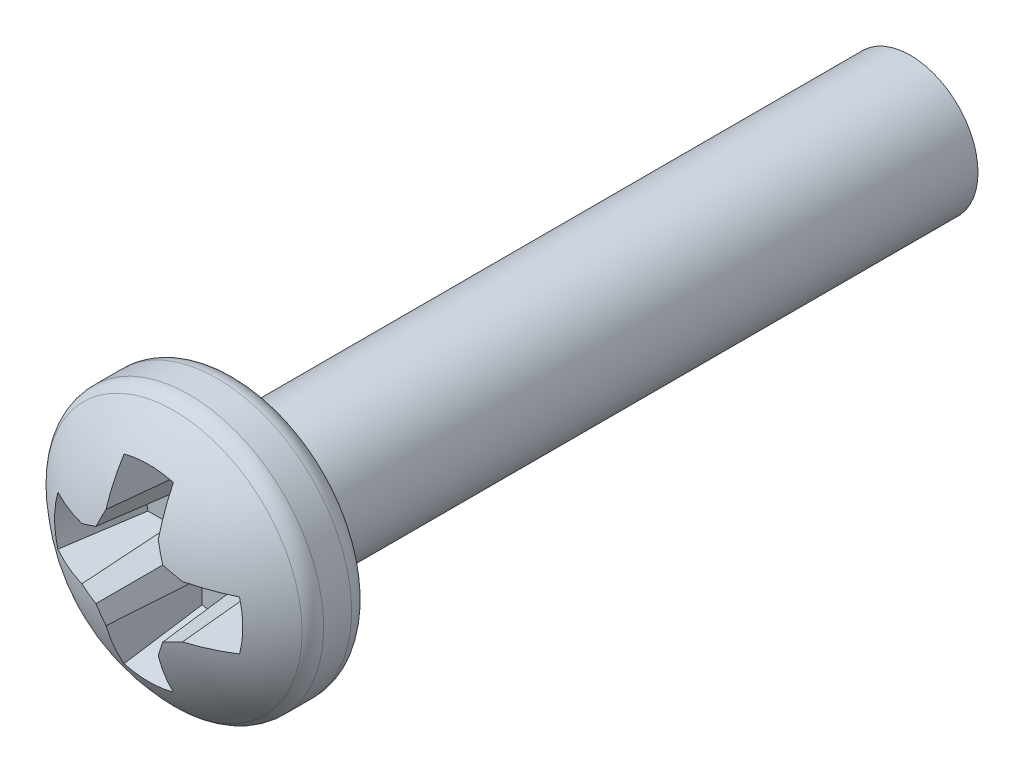
ISO-10303-21;
HEADER;
FILE_DESCRIPTION(('STEP AP214'),'2;1');
FILE_NAME('part.step','',(''),(''),'','','');
FILE_SCHEMA(('AUTOMOTIVE_DESIGN { 1 0 10303 214 1 1 1 1 }'));
ENDSEC;
DATA;
#1=APPLICATION_CONTEXT('core data for automotive mechanical design processes');
#2=APPLICATION_PROTOCOL_DEFINITION('international standard','automotive_design',2000,#1);
#3=PRODUCT_CONTEXT('',#1,'mechanical');
#4=PRODUCT('Part','Part','',(#3));
#5=PRODUCT_RELATED_PRODUCT_CATEGORY('part','',(#4));
#6=PRODUCT_DEFINITION_FORMATION('','',#4);
#7=PRODUCT_DEFINITION_CONTEXT('part definition',#1,'design');
#8=PRODUCT_DEFINITION('design','',#6,#7);
#9=PRODUCT_DEFINITION_SHAPE('','',#8);
#10=(LENGTH_UNIT() NAMED_UNIT(*) SI_UNIT(.MILLI.,.METRE.));
#11=(NAMED_UNIT(*) PLANE_ANGLE_UNIT() SI_UNIT($,.RADIAN.));
#12=(NAMED_UNIT(*) SI_UNIT($,.STERADIAN.) SOLID_ANGLE_UNIT());
#13=UNCERTAINTY_MEASURE_WITH_UNIT(LENGTH_MEASURE(1.E-05),#10,'distance_accuracy_value','');
#14=(GEOMETRIC_REPRESENTATION_CONTEXT(3) GLOBAL_UNCERTAINTY_ASSIGNED_CONTEXT((#13)) GLOBAL_UNIT_ASSIGNED_CONTEXT((#10,
#11,#12)) REPRESENTATION_CONTEXT('',''));
#15=CARTESIAN_POINT('',(0.,0.,0.));
#16=DIRECTION('',(0.,0.,1.));
#17=DIRECTION('',(1.,0.,0.));
#18=AXIS2_PLACEMENT_3D('',#15,#16,#17);
#19=CARTESIAN_POINT('',(0.251256313292348,0.606586399182261,11.7));
#20=DIRECTION('',(-0.381227206369648,-0.920363891963227,0.0871557427476583));
#21=DIRECTION('',(0.923879532511289,-0.382683432365084,0.));
#22=AXIS2_PLACEMENT_3D('',#19,#20,#21);
#23=PLANE('',#22);
#24=DIRECTION('',(0.923879532511289,-0.382683432365084,0.));
#25=VECTOR('',#24,1.);
#26=CARTESIAN_POINT('',(0.202877045628459,0.489788515050419,10.255));
#27=LINE('',#26,#25);
#28=CARTESIAN_POINT('',(0.405754091256926,0.405754091256925,10.255));
#29=VERTEX_POINT('',#28);
#30=CARTESIAN_POINT('',(0.72485327597371,0.273578881205037,10.255));
#31=VERTEX_POINT('',#30);
#32=EDGE_CURVE('E175',#29,#31,#27,.T.);
#33=ORIENTED_EDGE('',*,*,#32,.T.);
#34=DIRECTION('',(-0.0173337504938599,-0.0871426484044397,-0.996045029063886));
#35=VECTOR('',#34,1.);
#36=CARTESIAN_POINT('',(0.747722237309717,0.388548913673446,11.5691134843641));
#37=LINE('',#36,#35);
#38=CARTESIAN_POINT('',(0.747722237309717,0.388548913673446,11.5691134843641));
#39=VERTEX_POINT('',#38);
#40=EDGE_CURVE('E178',#39,#31,#37,.T.);
#41=ORIENTED_EDGE('',*,*,#40,.F.);
#42=CARTESIAN_POINT('',(0.747722237309717,0.388548913673446,11.5691134843641));
#43=CARTESIAN_POINT('',(0.706240595369678,0.406589864651121,11.5781812676126));
#44=CARTESIAN_POINT('',(0.664562351791498,0.42460402789441,11.5861062190338));
#45=CARTESIAN_POINT('',(0.580812661358855,0.460578778912214,11.5996704582213));
#46=CARTESIAN_POINT('',(0.538741214504392,0.47853936668673,11.6053097459877));
#47=CARTESIAN_POINT('',(0.496473166011788,0.496473166726859,11.6098062019267));
#48=B_SPLINE_CURVE_WITH_KNOTS('',3,(#42,#43,#44,#45,#46,#47),.UNSPECIFIED.,.F.,.F.,(4,2,4),(0.,
0.138273346243273,0.276546692486546),.UNSPECIFIED.);
#49=CARTESIAN_POINT('',(0.496473166111229,0.496473166977632,11.609806201862));
#50=VERTEX_POINT('',#49);
#51=EDGE_CURVE('E161',#39,#50,#48,.T.);
#52=ORIENTED_EDGE('',*,*,#51,.T.);
#53=DIRECTION('',(0.0666626913468327,0.0666626913468324,0.995546167269401));
#54=VECTOR('',#53,1.);
#55=CARTESIAN_POINT('',(0.405754091256926,0.405754091256925,10.255));
#56=LINE('',#55,#54);
#57=EDGE_CURVE('E187',#29,#50,#56,.T.);
#58=ORIENTED_EDGE('',*,*,#57,.F.);
#59=EDGE_LOOP('',(#33,#41,#52,#58));
#60=FACE_BOUND('',#59,.T.);
#61=ADVANCED_FACE('F17',(#60),#23,.T.);
#62=CARTESIAN_POINT('',(0.251256313292361,-0.60658639918228,11.7));
#63=DIRECTION('',(-0.381227206369641,0.920363891963229,0.0871557427476603));
#64=DIRECTION('',(-0.923879532511292,-0.382683432365078,0.));
#65=AXIS2_PLACEMENT_3D('',#62,#63,#64);
#66=PLANE('',#65);
#67=DIRECTION('',(-0.923879532511292,-0.382683432365078,0.));
#68=VECTOR('',#67,1.);
#69=CARTESIAN_POINT('',(0.202877045628472,-0.489788515050435,10.255));
#70=LINE('',#69,#68);
#71=CARTESIAN_POINT('',(0.724853275973724,-0.273578881205057,10.255));
#72=VERTEX_POINT('',#71);
#73=CARTESIAN_POINT('',(0.405754091256938,-0.405754091256942,10.255));
#74=VERTEX_POINT('',#73);
#75=EDGE_CURVE('E357',#72,#74,#70,.T.);
#76=ORIENTED_EDGE('',*,*,#75,.T.);
#77=DIRECTION('',(-0.0666626913468337,0.0666626913468343,-0.995546167269401));
#78=VECTOR('',#77,1.);
#79=CARTESIAN_POINT('',(0.49647316651386,-0.496473166513865,11.6098062018733));
#80=LINE('',#79,#78);
#81=CARTESIAN_POINT('',(0.496473166867044,-0.496473166364015,11.6098062018357));
#82=VERTEX_POINT('',#81);
#83=EDGE_CURVE('E347',#82,#74,#80,.T.);
#84=ORIENTED_EDGE('',*,*,#83,.F.);
#85=CARTESIAN_POINT('',(0.496473167220227,-0.496473166214166,11.6098062017981));
#86=CARTESIAN_POINT('',(0.538741215508183,-0.47853936625876,11.6053097458587));
#87=CARTESIAN_POINT('',(0.58081266215962,-0.460578778569332,11.5996704581028));
#88=CARTESIAN_POINT('',(0.664562352189455,-0.424604027722433,11.5861062189582));
#89=CARTESIAN_POINT('',(0.706240595567853,-0.406589864564961,11.5781812675693));
#90=CARTESIAN_POINT('',(0.747722237309732,-0.388548913673467,11.5691134843641));
#91=B_SPLINE_CURVE_WITH_KNOTS('',3,(#85,#86,#87,#88,#89,#90),.UNSPECIFIED.,.F.,.F.,(4,2,4),(0.,
0.138273345583997,0.276546691167995),.UNSPECIFIED.);
#92=CARTESIAN_POINT('',(0.747722237309732,-0.388548913673467,11.5691134843641));
#93=VERTEX_POINT('',#92);
#94=EDGE_CURVE('E359',#82,#93,#91,.T.);
#95=ORIENTED_EDGE('',*,*,#94,.T.);
#96=DIRECTION('',(0.0173337504938609,-0.0871426484044412,0.996045029063886));
#97=VECTOR('',#96,1.);
#98=CARTESIAN_POINT('',(0.724853275973724,-0.273578881205057,10.255));
#99=LINE('',#98,#97);
#100=EDGE_CURVE('E314',#72,#93,#99,.T.);
#101=ORIENTED_EDGE('',*,*,#100,.F.);
#102=EDGE_LOOP('',(#76,#84,#95,#101));
#103=FACE_BOUND('',#102,.T.);
#104=ADVANCED_FACE('F530',(#103),#66,.T.);
#105=CARTESIAN_POINT('',(0.606586399182278,-0.251256313292368,11.7));
#106=DIRECTION('',(-0.920363891963225,0.381227206369651,0.0871557427476603));
#107=DIRECTION('',(-0.382683432365087,-0.923879532511288,0.));
#108=AXIS2_PLACEMENT_3D('',#105,#106,#107);
#109=PLANE('',#108);
#110=DIRECTION('',(-0.382683432365087,-0.923879532511288,0.));
#111=VECTOR('',#110,1.);
#112=CARTESIAN_POINT('',(0.489788515050433,-0.202877045628477,10.255));
#113=LINE('',#112,#111);
#114=CARTESIAN_POINT('',(0.27357888120505,-0.724853275973728,10.255));
#115=VERTEX_POINT('',#114);
#116=EDGE_CURVE('E350',#74,#115,#113,.T.);
#117=ORIENTED_EDGE('',*,*,#116,.T.);
#118=DIRECTION('',(-0.0871426484044411,0.0173337504938618,-0.996045029063885));
#119=VECTOR('',#118,1.);
#120=CARTESIAN_POINT('',(0.38854891367346,-0.747722237309736,11.5691134843641));
#121=LINE('',#120,#119);
#122=CARTESIAN_POINT('',(0.38854891367346,-0.747722237309736,11.5691134843641));
#123=VERTEX_POINT('',#122);
#124=EDGE_CURVE('E308',#123,#115,#121,.T.);
#125=ORIENTED_EDGE('',*,*,#124,.F.);
#126=CARTESIAN_POINT('',(0.38854891367346,-0.747722237309736,11.5691134843641));
#127=CARTESIAN_POINT('',(0.406589864650785,-0.706240595370503,11.5781812676125));
#128=CARTESIAN_POINT('',(0.424604027893725,-0.664562351793134,11.5861062190335));
#129=CARTESIAN_POINT('',(0.460578778910836,-0.580812661362128,11.5996704582209));
#130=CARTESIAN_POINT('',(0.478539366685007,-0.53874121450849,11.6053097459872));
#131=CARTESIAN_POINT('',(0.496473166724792,-0.496473166016718,11.6098062019261));
#132=B_SPLINE_CURVE_WITH_KNOTS('',3,(#126,#127,#128,#129,#130,#131),.UNSPECIFIED.,.F.,.F.,(4,2,
4),(0.,0.138273346240595,0.276546692481189),.UNSPECIFIED.);
#133=EDGE_CURVE('E351',#123,#82,#132,.T.);
#134=ORIENTED_EDGE('',*,*,#133,.T.);
#135=ORIENTED_EDGE('',*,*,#83,.T.);
#136=EDGE_LOOP('',(#117,#125,#134,#135));
#137=FACE_BOUND('',#136,.T.);
#138=ADVANCED_FACE('F547',(#137),#109,.T.);
#139=CARTESIAN_POINT('',(-0.606586399182264,-0.251256313292377,11.7));
#140=DIRECTION('',(0.920363891963231,0.381227206369638,0.0871557427476595));
#141=DIRECTION('',(-0.382683432365074,0.923879532511293,0.));
#142=AXIS2_PLACEMENT_3D('',#139,#140,#141);
#143=PLANE('',#142);
#144=DIRECTION('',(-0.382683432365074,0.923879532511293,0.));
#145=VECTOR('',#144,1.);
#146=CARTESIAN_POINT('',(-0.48978851505042,-0.202877045628488,10.255));
#147=LINE('',#146,#145);
#148=CARTESIAN_POINT('',(-0.273578881205045,-0.724853275973738,10.255));
#149=VERTEX_POINT('',#148);
#150=CARTESIAN_POINT('',(-0.405754091256928,-0.405754091256952,10.255));
#151=VERTEX_POINT('',#150);
#152=EDGE_CURVE('E342',#149,#151,#147,.T.);
#153=ORIENTED_EDGE('',*,*,#152,.T.);
#154=DIRECTION('',(0.0666626913468332,0.0666626913468348,-0.995546167269401));
#155=VECTOR('',#154,1.);
#156=CARTESIAN_POINT('',(-0.496473166513849,-0.496473166513876,11.6098062018733));
#157=LINE('',#156,#155);
#158=CARTESIAN_POINT('',(-0.496473166362261,-0.496473166871155,11.6098062018353));
#159=VERTEX_POINT('',#158);
#160=EDGE_CURVE('E332',#159,#151,#157,.T.);
#161=ORIENTED_EDGE('',*,*,#160,.F.);
#162=CARTESIAN_POINT('',(-0.496473166210673,-0.496473167228434,11.6098062017973));
#163=CARTESIAN_POINT('',(-0.478539366255842,-0.538741215515004,11.6053097458578));
#164=CARTESIAN_POINT('',(-0.460578778566992,-0.580812662165064,11.599670458102));
#165=CARTESIAN_POINT('',(-0.424604027721252,-0.664562352192169,11.5861062189576));
#166=CARTESIAN_POINT('',(-0.406589864564363,-0.706240595569213,11.5781812675691));
#167=CARTESIAN_POINT('',(-0.388548913673453,-0.747722237309748,11.5691134843641));
#168=B_SPLINE_CURVE_WITH_KNOTS('',3,(#162,#163,#164,#165,#166,#167),.UNSPECIFIED.,.F.,.F.,(4,2,
4),(0.,0.138273345579528,0.276546691159055),.UNSPECIFIED.);
#169=CARTESIAN_POINT('',(-0.388548913673453,-0.747722237309748,11.5691134843641));
#170=VERTEX_POINT('',#169);
#171=EDGE_CURVE('E344',#159,#170,#168,.T.);
#172=ORIENTED_EDGE('',*,*,#171,.T.);
#173=DIRECTION('',(-0.0871426484044398,-0.0173337504938622,0.996045029063886));
#174=VECTOR('',#173,1.);
#175=CARTESIAN_POINT('',(-0.273578881205045,-0.724853275973738,10.255));
#176=LINE('',#175,#174);
#177=EDGE_CURVE('E302',#149,#170,#176,.T.);
#178=ORIENTED_EDGE('',*,*,#177,.F.);
#179=EDGE_LOOP('',(#153,#161,#172,#178));
#180=FACE_BOUND('',#179,.T.);
#181=ADVANCED_FACE('F551',(#180),#143,.T.);
#182=CARTESIAN_POINT('',(-0.251256313292352,-0.606586399182294,11.7));
#183=DIRECTION('',(0.381227206369654,0.920363891963224,0.0871557427476611));
#184=DIRECTION('',(-0.923879532511287,0.38268343236509,0.));
#185=AXIS2_PLACEMENT_3D('',#182,#183,#184);
#186=PLANE('',#185);
#187=DIRECTION('',(-0.923879532511287,0.38268343236509,0.));
#188=VECTOR('',#187,1.);
#189=CARTESIAN_POINT('',(-0.202877045628461,-0.489788515050449,10.255));
#190=LINE('',#189,#188);
#191=CARTESIAN_POINT('',(-0.724853275973714,-0.273578881205062,10.255));
#192=VERTEX_POINT('',#191);
#193=EDGE_CURVE('E335',#151,#192,#190,.T.);
#194=ORIENTED_EDGE('',*,*,#193,.T.);
#195=DIRECTION('',(0.0173337504938607,0.0871426484044425,-0.996045029063885));
#196=VECTOR('',#195,1.);
#197=CARTESIAN_POINT('',(-0.74772223730972,-0.388548913673475,11.5691134843641));
#198=LINE('',#197,#196);
#199=CARTESIAN_POINT('',(-0.74772223730972,-0.388548913673475,11.5691134843641));
#200=VERTEX_POINT('',#199);
#201=EDGE_CURVE('E290',#200,#192,#198,.T.);
#202=ORIENTED_EDGE('',*,*,#201,.F.);
#203=CARTESIAN_POINT('',(-0.747722237309721,-0.388548913673475,11.5691134843641));
#204=CARTESIAN_POINT('',(-0.706240595369682,-0.40658986465115,11.5781812676126));
#205=CARTESIAN_POINT('',(-0.664562351791502,-0.424604027894439,11.5861062190338));
#206=CARTESIAN_POINT('',(-0.580812661358859,-0.460578778912244,11.5996704582213));
#207=CARTESIAN_POINT('',(-0.538741214504396,-0.47853936668676,11.6053097459877));
#208=CARTESIAN_POINT('',(-0.496473166011792,-0.49647316672689,11.6098062019266));
#209=B_SPLINE_CURVE_WITH_KNOTS('',3,(#203,#204,#205,#206,#207,#208),.UNSPECIFIED.,.F.,.F.,(4,2,
4),(0.,0.138273346243273,0.276546692486546),.UNSPECIFIED.);
#210=EDGE_CURVE('E336',#200,#159,#209,.T.);
#211=ORIENTED_EDGE('',*,*,#210,.T.);
#212=ORIENTED_EDGE('',*,*,#160,.T.);
#213=EDGE_LOOP('',(#194,#202,#211,#212));
#214=FACE_BOUND('',#213,.T.);
#215=ADVANCED_FACE('F556',(#214),#186,.T.);
#216=CARTESIAN_POINT('',(-0.251256313292357,0.606586399182247,11.7));
#217=DIRECTION('',(0.381227206369635,-0.920363891963232,0.0871557427476575));
#218=DIRECTION('',(0.923879532511295,0.382683432365071,0.));
#219=AXIS2_PLACEMENT_3D('',#216,#217,#218);
#220=PLANE('',#219);
#221=DIRECTION('',(0.923879532511295,0.382683432365071,0.));
#222=VECTOR('',#221,1.);
#223=CARTESIAN_POINT('',(-0.20287704562847,0.489788515050406,10.255));
#224=LINE('',#223,#222);
#225=CARTESIAN_POINT('',(-0.724853275973722,0.273578881205032,10.255));
#226=VERTEX_POINT('',#225);
#227=CARTESIAN_POINT('',(-0.405754091256936,0.405754091256915,10.255));
#228=VERTEX_POINT('',#227);
#229=EDGE_CURVE('E327',#226,#228,#224,.T.);
#230=ORIENTED_EDGE('',*,*,#229,.T.);
#231=DIRECTION('',(0.0666626913468333,-0.0666626913468319,-0.995546167269401));
#232=VECTOR('',#231,1.);
#233=CARTESIAN_POINT('',(-0.496473166513857,0.496473166513834,11.6098062018733));
#234=LINE('',#233,#232);
#235=CARTESIAN_POINT('',(-0.49647316686704,0.496473166363984,11.6098062018357));
#236=VERTEX_POINT('',#235);
#237=EDGE_CURVE('E284',#236,#228,#234,.T.);
#238=ORIENTED_EDGE('',*,*,#237,.F.);
#239=CARTESIAN_POINT('',(-0.496473167220223,0.496473166214135,11.6098062017981));
#240=CARTESIAN_POINT('',(-0.538741215508179,0.47853936625873,11.6053097458587));
#241=CARTESIAN_POINT('',(-0.580812662159616,0.460578778569302,11.5996704581028));
#242=CARTESIAN_POINT('',(-0.664562352189452,0.424604027722403,11.5861062189582));
#243=CARTESIAN_POINT('',(-0.70624059556785,0.406589864564932,11.5781812675693));
#244=CARTESIAN_POINT('',(-0.747722237309729,0.388548913673438,11.5691134843641));
#245=B_SPLINE_CURVE_WITH_KNOTS('',3,(#239,#240,#241,#242,#243,#244),.UNSPECIFIED.,.F.,.F.,(4,2,
4),(0.,0.138273345583997,0.276546691167995),.UNSPECIFIED.);
#246=CARTESIAN_POINT('',(-0.747722237309729,0.388548913673438,11.5691134843641));
#247=VERTEX_POINT('',#246);
#248=EDGE_CURVE('E329',#236,#247,#245,.T.);
#249=ORIENTED_EDGE('',*,*,#248,.T.);
#250=DIRECTION('',(-0.0173337504938603,0.0871426484044384,0.996045029063886));
#251=VECTOR('',#250,1.);
#252=CARTESIAN_POINT('',(-0.724853275973722,0.273578881205032,10.255));
#253=LINE('',#252,#251);
#254=EDGE_CURVE('E296',#226,#247,#253,.T.);
#255=ORIENTED_EDGE('',*,*,#254,.F.);
#256=EDGE_LOOP('',(#230,#238,#249,#255));
#257=FACE_BOUND('',#256,.T.);
#258=ADVANCED_FACE('F572',(#257),#220,.T.);
#259=CARTESIAN_POINT('',(0.606586399182262,0.251256313292346,11.7));
#260=DIRECTION('',(-0.920363891963228,-0.381227206369645,0.0871557427476583));
#261=DIRECTION('',(0.382683432365081,-0.92387953251129,0.));
#262=AXIS2_PLACEMENT_3D('',#259,#260,#261);
#263=PLANE('',#262);
#264=DIRECTION('',(0.382683432365081,-0.92387953251129,0.));
#265=VECTOR('',#264,1.);
#266=CARTESIAN_POINT('',(0.48978851505042,0.202877045628457,10.255));
#267=LINE('',#266,#265);
#268=CARTESIAN_POINT('',(0.273578881205039,0.72485327597371,10.255));
#269=VERTEX_POINT('',#268);
#270=EDGE_CURVE('E189',#269,#29,#267,.T.);
#271=ORIENTED_EDGE('',*,*,#270,.T.);
#272=ORIENTED_EDGE('',*,*,#57,.T.);
#273=CARTESIAN_POINT('',(0.496473166210671,0.496473167228403,11.6098062017973));
#274=CARTESIAN_POINT('',(0.478539366255839,0.538741215514973,11.6053097458579));
#275=CARTESIAN_POINT('',(0.460578778566988,0.580812662165033,11.599670458102));
#276=CARTESIAN_POINT('',(0.424604027721248,0.664562352192138,11.5861062189576));
#277=CARTESIAN_POINT('',(0.406589864564358,0.706240595569182,11.5781812675691));
#278=CARTESIAN_POINT('',(0.388548913673449,0.747722237309717,11.5691134843641));
#279=B_SPLINE_CURVE_WITH_KNOTS('',3,(#273,#274,#275,#276,#277,#278),.UNSPECIFIED.,.F.,.F.,(4,2,
4),(0.,0.138273345579529,0.276546691159057),.UNSPECIFIED.);
#280=CARTESIAN_POINT('',(0.388548913673448,0.747722237309717,11.5691134843641));
#281=VERTEX_POINT('',#280);
#282=EDGE_CURVE('E171',#50,#281,#279,.T.);
#283=ORIENTED_EDGE('',*,*,#282,.T.);
#284=DIRECTION('',(0.0871426484044397,0.0173337504938599,0.996045029063886));
#285=VECTOR('',#284,1.);
#286=CARTESIAN_POINT('',(0.273578881205039,0.72485327597371,10.255));
#287=LINE('',#286,#285);
#288=EDGE_CURVE('E272',#269,#281,#287,.T.);
#289=ORIENTED_EDGE('',*,*,#288,.F.);
#290=EDGE_LOOP('',(#271,#272,#283,#289));
#291=FACE_BOUND('',#290,.T.);
#292=ADVANCED_FACE('F575',(#291),#263,.T.);
#293=CARTESIAN_POINT('',(0.,0.399999999999998,11.7));
#294=DIRECTION('',(0.,-0.996194698091746,0.0871557427476584));
#295=DIRECTION('',(0.,-0.0871557427476584,-0.996194698091746));
#296=AXIS2_PLACEMENT_3D('',#293,#294,#295);
#297=PLANE('',#296);
#298=DIRECTION('',(1.,0.,0.));
#299=VECTOR('',#298,1.);
#300=CARTESIAN_POINT('',(0.,0.273578881205037,10.255));
#301=LINE('',#300,#299);
#302=CARTESIAN_POINT('',(1.07866041768907,0.273578881205037,10.2549999999862));
#303=VERTEX_POINT('',#302);
#304=EDGE_CURVE('E263',#303,#31,#301,.F.);
#305=ORIENTED_EDGE('',*,*,#304,.F.);
#306=CARTESIAN_POINT('',(1.07866041768837,0.273578881203481,10.2549999999822));
#307=CARTESIAN_POINT('',(1.12387399307669,0.289138832841714,10.4328510610357));
#308=CARTESIAN_POINT('',(1.16907297531068,0.304699106366915,10.610705801274));
#309=CARTESIAN_POINT('',(1.25944175340125,0.335820297167585,10.9664226398499));
#310=CARTESIAN_POINT('',(1.30461154925788,0.351381214443052,11.1442847381874));
#311=CARTESIAN_POINT('',(1.34976675196023,0.366942453605488,11.3221505157098));
#312=B_SPLINE_CURVE_WITH_KNOTS('',3,(#306,#307,#308,#309,#310,#311),.UNSPECIFIED.,.F.,.F.,(4,2,
4),(0.,0.552500143521879,1.10500028620324),.UNSPECIFIED.);
#313=CARTESIAN_POINT('',(1.34976675196804,0.366942453606028,11.322150515716));
#314=VERTEX_POINT('',#313);
#315=EDGE_CURVE('E186',#303,#314,#312,.T.);
#316=ORIENTED_EDGE('',*,*,#315,.T.);
#317=CARTESIAN_POINT('',(1.34976675197584,0.366942453606568,11.3221505157221));
#318=CARTESIAN_POINT('',(1.25429248537478,0.371573566431086,11.3750843775264));
#319=CARTESIAN_POINT('',(1.15638497585207,0.375689661182252,11.4221315558153));
#320=CARTESIAN_POINT('',(0.955703470963361,0.382891814537878,11.5044525453626));
#321=CARTESIAN_POINT('',(0.852929475597361,0.385977873142338,11.539726356621));
#322=CARTESIAN_POINT('',(0.747722237309717,0.388548913673446,11.5691134843641));
#323=B_SPLINE_CURVE_WITH_KNOTS('',3,(#317,#318,#319,#320,#321,#322),.UNSPECIFIED.,.F.,.F.,(4,2,
4),(0.,0.326107860648934,0.652215721297869),.UNSPECIFIED.);
#324=EDGE_CURVE('E168',#314,#39,#323,.T.);
#325=ORIENTED_EDGE('',*,*,#324,.T.);
#326=ORIENTED_EDGE('',*,*,#40,.T.);
#327=EDGE_LOOP('',(#305,#316,#325,#326));
#328=FACE_BOUND('',#327,.T.);
#329=ADVANCED_FACE('F184',(#328),#297,.T.);
#330=CARTESIAN_POINT('',(0.,-0.400000000000017,11.7));
#331=DIRECTION('',(0.,0.996194698091745,0.0871557427476598));
#332=DIRECTION('',(0.,-0.0871557427476598,0.996194698091745));
#333=AXIS2_PLACEMENT_3D('',#330,#331,#332);
#334=PLANE('',#333);
#335=DIRECTION('',(1.,0.,0.));
#336=VECTOR('',#335,1.);
#337=CARTESIAN_POINT('',(0.,-0.273578881205057,10.255));
#338=LINE('',#337,#336);
#339=CARTESIAN_POINT('',(1.07866041768681,-0.27357888120428,10.2549999999773));
#340=VERTEX_POINT('',#339);
#341=EDGE_CURVE('E267',#72,#340,#338,.T.);
#342=ORIENTED_EDGE('',*,*,#341,.F.);
#343=ORIENTED_EDGE('',*,*,#100,.T.);
#344=CARTESIAN_POINT('',(0.747722237309732,-0.388548913673467,11.5691134843641));
#345=CARTESIAN_POINT('',(0.852929475597373,-0.38597787314236,11.539726356621));
#346=CARTESIAN_POINT('',(0.95570347096337,-0.3828918145379,11.5044525453626));
#347=CARTESIAN_POINT('',(1.15638497585207,-0.375689661182275,11.4221315558153));
#348=CARTESIAN_POINT('',(1.25429248537478,-0.37157356643111,11.3750843775264));
#349=CARTESIAN_POINT('',(1.34976675197584,-0.366942453606592,11.3221505157221));
#350=B_SPLINE_CURVE_WITH_KNOTS('',3,(#344,#345,#346,#347,#348,#349),.UNSPECIFIED.,.F.,.F.,(4,2,
4),(0.,0.326107860648925,0.65221572129785),.UNSPECIFIED.);
#351=CARTESIAN_POINT('',(1.34976675196803,-0.366942453606052,11.322150515716));
#352=VERTEX_POINT('',#351);
#353=EDGE_CURVE('E182',#93,#352,#350,.T.);
#354=ORIENTED_EDGE('',*,*,#353,.T.);
#355=CARTESIAN_POINT('',(1.34976675196022,-0.366942453605512,11.3221505157098));
#356=CARTESIAN_POINT('',(1.30461154925788,-0.351381214443076,11.1442847381874));
#357=CARTESIAN_POINT('',(1.25944175340125,-0.335820297167608,10.9664226398499));
#358=CARTESIAN_POINT('',(1.16907297531067,-0.304699106366938,10.610705801274));
#359=CARTESIAN_POINT('',(1.12387399307669,-0.289138832841735,10.4328510610357));
#360=CARTESIAN_POINT('',(1.07866041768837,-0.273578881203502,10.2549999999822));
#361=B_SPLINE_CURVE_WITH_KNOTS('',3,(#355,#356,#357,#358,#359,#360),.UNSPECIFIED.,.F.,.F.,(4,2,
4),(0.,0.552500142681358,1.10500028620324),.UNSPECIFIED.);
#362=EDGE_CURVE('E488',#352,#340,#361,.T.);
#363=ORIENTED_EDGE('',*,*,#362,.T.);
#364=EDGE_LOOP('',(#342,#343,#354,#363));
#365=FACE_BOUND('',#364,.T.);
#366=ADVANCED_FACE('F493',(#365),#334,.T.);
#367=CARTESIAN_POINT('',(0.400000000000015,0.,11.7));
#368=DIRECTION('',(-0.996194698091745,0.,0.0871557427476598));
#369=DIRECTION('',(0.0871557427476598,0.,0.996194698091745));
#370=AXIS2_PLACEMENT_3D('',#367,#368,#369);
#371=PLANE('',#370);
#372=DIRECTION('',(0.,1.,0.));
#373=VECTOR('',#372,1.);
#374=CARTESIAN_POINT('',(0.273578881205049,0.,10.255));
#375=LINE('',#374,#373);
#376=CARTESIAN_POINT('',(0.273578881205049,-1.07866041767911,10.2550000000146));
#377=VERTEX_POINT('',#376);
#378=EDGE_CURVE('E239',#377,#115,#375,.T.);
#379=ORIENTED_EDGE('',*,*,#378,.F.);
#380=CARTESIAN_POINT('',(0.273578881206636,-1.07866041767969,10.2550000000181));
#381=CARTESIAN_POINT('',(0.289138832844341,-1.12387399307169,10.4328510610655));
#382=CARTESIAN_POINT('',(0.304699106369014,-1.16907297530938,10.6107058012978));
#383=CARTESIAN_POINT('',(0.335820297168627,-1.25944175340738,10.9664226398616));
#384=CARTESIAN_POINT('',(0.351381214443566,-1.30461154926774,11.1442847381931));
#385=CARTESIAN_POINT('',(0.366942453605472,-1.34976675197382,11.3221505157095));
#386=B_SPLINE_CURVE_WITH_KNOTS('',3,(#380,#381,#382,#383,#384,#385),.UNSPECIFIED.,.F.,.F.,(4,2,
4),(0.,0.552500143506974,1.10500028617343),.UNSPECIFIED.);
#387=CARTESIAN_POINT('',(0.366942453605869,-1.34976675197808,11.322150515714));
#388=VERTEX_POINT('',#387);
#389=EDGE_CURVE('E473',#377,#388,#386,.T.);
#390=ORIENTED_EDGE('',*,*,#389,.T.);
#391=CARTESIAN_POINT('',(0.366942453606266,-1.34976675198234,11.3221505157185));
#392=CARTESIAN_POINT('',(0.371573566430859,-1.25429248538033,11.3750843775236));
#393=CARTESIAN_POINT('',(0.375689661182089,-1.1563849758566,11.4221315558133));
#394=CARTESIAN_POINT('',(0.38289181453782,-0.95570347096573,11.5044525453618));
#395=CARTESIAN_POINT('',(0.385977873142322,-0.852929475598587,11.5397263566207));
#396=CARTESIAN_POINT('',(0.38854891367346,-0.747722237309736,11.5691134843641));
#397=B_SPLINE_CURVE_WITH_KNOTS('',3,(#391,#392,#393,#394,#395,#396),.UNSPECIFIED.,.F.,.F.,(4,2,
4),(0.,0.326107860652638,0.652215721305276),.UNSPECIFIED.);
#398=EDGE_CURVE('E311',#388,#123,#397,.T.);
#399=ORIENTED_EDGE('',*,*,#398,.T.);
#400=ORIENTED_EDGE('',*,*,#124,.T.);
#401=EDGE_LOOP('',(#379,#390,#399,#400));
#402=FACE_BOUND('',#401,.T.);
#403=ADVANCED_FACE('F496',(#402),#371,.T.);
#404=CARTESIAN_POINT('',(-0.4,0.,11.7));
#405=DIRECTION('',(0.996194698091746,0.,0.0871557427476584));
#406=DIRECTION('',(0.0871557427476584,0.,-0.996194698091746));
#407=AXIS2_PLACEMENT_3D('',#404,#405,#406);
#408=PLANE('',#407);
#409=DIRECTION('',(0.,1.,0.));
#410=VECTOR('',#409,1.);
#411=CARTESIAN_POINT('',(-0.273578881205045,0.,10.255));
#412=LINE('',#411,#410);
#413=CARTESIAN_POINT('',(-0.27357888120584,-1.07866041768141,10.2550000000237));
#414=VERTEX_POINT('',#413);
#415=EDGE_CURVE('E242',#149,#414,#412,.F.);
#416=ORIENTED_EDGE('',*,*,#415,.F.);
#417=ORIENTED_EDGE('',*,*,#177,.T.);
#418=CARTESIAN_POINT('',(-0.388548913673453,-0.747722237309748,11.5691134843641));
#419=CARTESIAN_POINT('',(-0.385977873142316,-0.852929475598597,11.5397263566207));
#420=CARTESIAN_POINT('',(-0.382891814537815,-0.955703470965737,11.5044525453618));
#421=CARTESIAN_POINT('',(-0.375689661182086,-1.1563849758566,11.4221315558133));
#422=CARTESIAN_POINT('',(-0.371573566430858,-1.25429248538033,11.3750843775236));
#423=CARTESIAN_POINT('',(-0.366942453606266,-1.34976675198234,11.3221505157185));
#424=B_SPLINE_CURVE_WITH_KNOTS('',3,(#418,#419,#420,#421,#422,#423),.UNSPECIFIED.,.F.,.F.,(4,2,
4),(0.,0.326107860652632,0.652215721305264),.UNSPECIFIED.);
#425=CARTESIAN_POINT('',(-0.366942453605868,-1.34976675197807,11.322150515714));
#426=VERTEX_POINT('',#425);
#427=EDGE_CURVE('E305',#170,#426,#424,.T.);
#428=ORIENTED_EDGE('',*,*,#427,.T.);
#429=CARTESIAN_POINT('',(-0.366942453605472,-1.34976675197381,11.3221505157095));
#430=CARTESIAN_POINT('',(-0.351381214443565,-1.30461154926773,11.1442847381931));
#431=CARTESIAN_POINT('',(-0.335820297168626,-1.25944175340737,10.9664226398616));
#432=CARTESIAN_POINT('',(-0.304699106369013,-1.16907297530937,10.6107058012978));
#433=CARTESIAN_POINT('',(-0.289138832844339,-1.12387399307169,10.4328510610655));
#434=CARTESIAN_POINT('',(-0.273578881206634,-1.07866041767968,10.2550000000181));
#435=B_SPLINE_CURVE_WITH_KNOTS('',3,(#429,#430,#431,#432,#433,#434),.UNSPECIFIED.,.F.,.F.,(4,2,
4),(0.,0.552500142666454,1.10500028617343),.UNSPECIFIED.);
#436=EDGE_CURVE('E468',#426,#414,#435,.T.);
#437=ORIENTED_EDGE('',*,*,#436,.T.);
#438=EDGE_LOOP('',(#416,#417,#428,#437));
#439=FACE_BOUND('',#438,.T.);
#440=ADVANCED_FACE('F454',(#439),#408,.T.);
#441=CARTESIAN_POINT('',(0.,0.399999999999983,11.7));
#442=DIRECTION('',(0.,-0.996194698091746,0.0871557427476569));
#443=DIRECTION('',(0.,-0.0871557427476569,-0.996194698091746));
#444=AXIS2_PLACEMENT_3D('',#441,#442,#443);
#445=PLANE('',#444);
#446=DIRECTION('',(1.,0.,0.));
#447=VECTOR('',#446,1.);
#448=CARTESIAN_POINT('',(0.,0.273578881205032,10.255));
#449=LINE('',#448,#447);
#450=CARTESIAN_POINT('',(-1.0786604176868,0.273578881204256,10.2549999999773));
#451=VERTEX_POINT('',#450);
#452=EDGE_CURVE('E252',#226,#451,#449,.F.);
#453=ORIENTED_EDGE('',*,*,#452,.F.);
#454=ORIENTED_EDGE('',*,*,#254,.T.);
#455=CARTESIAN_POINT('',(-0.747722237309729,0.388548913673438,11.5691134843641));
#456=CARTESIAN_POINT('',(-0.852929475599294,0.385977873142285,11.5397263566205));
#457=CARTESIAN_POINT('',(-0.955703470967113,0.38289181453776,11.5044525453613));
#458=CARTESIAN_POINT('',(-1.15638497585926,0.37568966118197,11.4221315558121));
#459=CARTESIAN_POINT('',(-1.25429248538359,0.371573566430703,11.375084377522));
#460=CARTESIAN_POINT('',(-1.34976675198617,0.366942453606066,11.3221505157164));
#461=B_SPLINE_CURVE_WITH_KNOTS('',3,(#455,#456,#457,#458,#459,#460),.UNSPECIFIED.,.F.,.F.,(4,2,
4),(0.,0.326107860654829,0.652215721309657),.UNSPECIFIED.);
#462=CARTESIAN_POINT('',(-1.34976675198749,0.366942453605627,11.3221505157114));
#463=VERTEX_POINT('',#462);
#464=EDGE_CURVE('E299',#247,#463,#461,.T.);
#465=ORIENTED_EDGE('',*,*,#464,.T.);
#466=CARTESIAN_POINT('',(-1.3497667519888,0.366942453605188,11.3221505157064));
#467=CARTESIAN_POINT('',(-1.30461154928167,0.351381214442803,11.1442847381845));
#468=CARTESIAN_POINT('',(-1.25944175342027,0.335820297167385,10.9664226398476));
#469=CARTESIAN_POINT('',(-1.16907297532016,0.304699106366815,10.6107058012728));
#470=CARTESIAN_POINT('',(-1.12387399308142,0.289138832841662,10.4328510610351));
#471=CARTESIAN_POINT('',(-1.07866041768836,0.273578881203479,10.2549999999822));
#472=B_SPLINE_CURVE_WITH_KNOTS('',3,(#466,#467,#468,#469,#470,#471),.UNSPECIFIED.,.F.,.F.,(4,2,
4),(0.,0.5525001426832,1.10500028620692),.UNSPECIFIED.);
#473=EDGE_CURVE('E460',#463,#451,#472,.T.);
#474=ORIENTED_EDGE('',*,*,#473,.T.);
#475=EDGE_LOOP('',(#453,#454,#465,#474));
#476=FACE_BOUND('',#475,.T.);
#477=ADVANCED_FACE('F448',(#476),#445,.T.);
#478=CARTESIAN_POINT('',(0.,-0.400000000000032,11.7));
#479=DIRECTION('',(0.,0.996194698091745,0.0871557427476613));
#480=DIRECTION('',(0.,-0.0871557427476613,0.996194698091745));
#481=AXIS2_PLACEMENT_3D('',#478,#479,#480);
#482=PLANE('',#481);
#483=DIRECTION('',(1.,0.,0.));
#484=VECTOR('',#483,1.);
#485=CARTESIAN_POINT('',(0.,-0.27357888120506,10.255));
#486=LINE('',#485,#484);
#487=CARTESIAN_POINT('',(-1.07866041768907,-0.27357888120506,10.2549999999862));
#488=VERTEX_POINT('',#487);
#489=EDGE_CURVE('E247',#488,#192,#486,.T.);
#490=ORIENTED_EDGE('',*,*,#489,.F.);
#491=CARTESIAN_POINT('',(-1.07866041768837,-0.273578881203504,10.2549999999822));
#492=CARTESIAN_POINT('',(-1.12387399308143,-0.289138832841687,10.4328510610351));
#493=CARTESIAN_POINT('',(-1.16907297532018,-0.304699106366839,10.6107058012728));
#494=CARTESIAN_POINT('',(-1.25944175342028,-0.33582029716741,10.9664226398476));
#495=CARTESIAN_POINT('',(-1.30461154928168,-0.351381214442827,11.1442847381845));
#496=CARTESIAN_POINT('',(-1.34976675198881,-0.366942453605213,11.3221505157064));
#497=B_SPLINE_CURVE_WITH_KNOTS('',3,(#491,#492,#493,#494,#495,#496),.UNSPECIFIED.,.F.,.F.,(4,2,
4),(0.,0.552500143523723,1.10500028620692),.UNSPECIFIED.);
#498=CARTESIAN_POINT('',(-1.34976675198749,-0.366942453605651,11.3221505157114));
#499=VERTEX_POINT('',#498);
#500=EDGE_CURVE('E231',#488,#499,#497,.T.);
#501=ORIENTED_EDGE('',*,*,#500,.T.);
#502=CARTESIAN_POINT('',(-1.34976675198617,-0.36694245360609,11.3221505157164));
#503=CARTESIAN_POINT('',(-1.25429248538359,-0.37157356643073,11.375084377522));
#504=CARTESIAN_POINT('',(-1.15638497585926,-0.375689661181998,11.4221315558121));
#505=CARTESIAN_POINT('',(-0.955703470967109,-0.382891814537792,11.5044525453613));
#506=CARTESIAN_POINT('',(-0.852929475599287,-0.385977873142319,11.5397263566205));
#507=CARTESIAN_POINT('',(-0.747722237309721,-0.388548913673474,11.5691134843641));
#508=B_SPLINE_CURVE_WITH_KNOTS('',3,(#502,#503,#504,#505,#506,#507),.UNSPECIFIED.,.F.,.F.,(4,2,
4),(0.,0.326107860654835,0.65221572130967),.UNSPECIFIED.);
#509=EDGE_CURVE('E293',#499,#200,#508,.T.);
#510=ORIENTED_EDGE('',*,*,#509,.T.);
#511=ORIENTED_EDGE('',*,*,#201,.T.);
#512=EDGE_LOOP('',(#490,#501,#510,#511));
#513=FACE_BOUND('',#512,.T.);
#514=ADVANCED_FACE('F445',(#513),#482,.T.);
#515=CARTESIAN_POINT('',(-0.606586399182276,0.251256313292337,11.7));
#516=DIRECTION('',(0.920363891963223,-0.381227206369657,0.0871557427476591));
#517=DIRECTION('',(0.382683432365094,0.923879532511285,0.));
#518=AXIS2_PLACEMENT_3D('',#515,#516,#517);
#519=PLANE('',#518);
#520=DIRECTION('',(-0.382683432365094,-0.923879532511285,0.));
#521=VECTOR('',#520,1.);
#522=CARTESIAN_POINT('',(-0.273578881205045,0.724853275973699,10.255));
#523=LINE('',#522,#521);
#524=CARTESIAN_POINT('',(-0.273578881205045,0.724853275973699,10.255));
#525=VERTEX_POINT('',#524);
#526=EDGE_CURVE('E257',#525,#228,#523,.T.);
#527=ORIENTED_EDGE('',*,*,#526,.F.);
#528=DIRECTION('',(0.087142648404441,-0.0173337504938594,-0.996045029063885));
#529=VECTOR('',#528,1.);
#530=CARTESIAN_POINT('',(-0.388548913673455,0.747722237309705,11.5691134843641));
#531=LINE('',#530,#529);
#532=CARTESIAN_POINT('',(-0.388548913673455,0.747722237309705,11.5691134843641));
#533=VERTEX_POINT('',#532);
#534=EDGE_CURVE('E227',#533,#525,#531,.T.);
#535=ORIENTED_EDGE('',*,*,#534,.F.);
#536=CARTESIAN_POINT('',(-0.388548913673455,0.747722237309705,11.5691134843641));
#537=CARTESIAN_POINT('',(-0.40658986465078,0.706240595370471,11.5781812676125));
#538=CARTESIAN_POINT('',(-0.424604027893721,0.664562351793103,11.5861062190335));
#539=CARTESIAN_POINT('',(-0.460578778910832,0.580812661362097,11.5996704582209));
#540=CARTESIAN_POINT('',(-0.478539366685003,0.53874121450846,11.6053097459872));
#541=CARTESIAN_POINT('',(-0.496473166724789,0.496473166016688,11.6098062019261));
#542=B_SPLINE_CURVE_WITH_KNOTS('',3,(#536,#537,#538,#539,#540,#541),.UNSPECIFIED.,.F.,.F.,(4,2,
4),(0.,0.138273346240594,0.276546692481188),.UNSPECIFIED.);
#543=EDGE_CURVE('E287',#533,#236,#542,.T.);
#544=ORIENTED_EDGE('',*,*,#543,.T.);
#545=ORIENTED_EDGE('',*,*,#237,.T.);
#546=EDGE_LOOP('',(#527,#535,#544,#545));
#547=FACE_BOUND('',#546,.T.);
#548=ADVANCED_FACE('F414',(#547),#519,.T.);
#549=CARTESIAN_POINT('',(0.4,0.,11.7));
#550=DIRECTION('',(-0.996194698091746,0.,0.0871557427476584));
#551=DIRECTION('',(0.0871557427476584,0.,0.996194698091746));
#552=AXIS2_PLACEMENT_3D('',#549,#550,#551);
#553=PLANE('',#552);
#554=DIRECTION('',(0.,1.,0.));
#555=VECTOR('',#554,1.);
#556=CARTESIAN_POINT('',(0.273578881205039,0.,10.255));
#557=LINE('',#556,#555);
#558=CARTESIAN_POINT('',(0.273578881204261,1.07866041768681,10.2549999999773));
#559=VERTEX_POINT('',#558);
#560=EDGE_CURVE('E260',#269,#559,#557,.T.);
#561=ORIENTED_EDGE('',*,*,#560,.F.);
#562=ORIENTED_EDGE('',*,*,#288,.T.);
#563=CARTESIAN_POINT('',(0.388548913673448,0.747722237309717,11.5691134843641));
#564=CARTESIAN_POINT('',(0.38597787314234,0.852929475597361,11.539726356621));
#565=CARTESIAN_POINT('',(0.38289181453788,0.95570347096336,11.5044525453626));
#566=CARTESIAN_POINT('',(0.375689661182254,1.15638497585207,11.4221315558153));
#567=CARTESIAN_POINT('',(0.371573566431088,1.25429248537478,11.3750843775264));
#568=CARTESIAN_POINT('',(0.36694245360657,1.34976675197584,11.3221505157221));
#569=B_SPLINE_CURVE_WITH_KNOTS('',3,(#563,#564,#565,#566,#567,#568),.UNSPECIFIED.,.F.,.F.,(4,2,
4),(0.,0.326107860648933,0.652215721297867),.UNSPECIFIED.);
#570=CARTESIAN_POINT('',(0.36694245360603,1.34976675196803,11.322150515716));
#571=VERTEX_POINT('',#570);
#572=EDGE_CURVE('E277',#281,#571,#569,.T.);
#573=ORIENTED_EDGE('',*,*,#572,.T.);
#574=CARTESIAN_POINT('',(0.36694245360549,1.34976675196023,11.3221505157098));
#575=CARTESIAN_POINT('',(0.351381214443055,1.30461154925788,11.1442847381874));
#576=CARTESIAN_POINT('',(0.335820297167587,1.25944175340125,10.9664226398499));
#577=CARTESIAN_POINT('',(0.304699106366917,1.16907297531068,10.610705801274));
#578=CARTESIAN_POINT('',(0.289138832841716,1.12387399307669,10.4328510610357));
#579=CARTESIAN_POINT('',(0.273578881203483,1.07866041768837,10.2549999999822));
#580=B_SPLINE_CURVE_WITH_KNOTS('',3,(#574,#575,#576,#577,#578,#579),.UNSPECIFIED.,.F.,.F.,(4,2,
4),(0.,0.552500142681358,1.10500028620324),.UNSPECIFIED.);
#581=EDGE_CURVE('E236',#571,#559,#580,.T.);
#582=ORIENTED_EDGE('',*,*,#581,.T.);
#583=EDGE_LOOP('',(#561,#562,#573,#582));
#584=FACE_BOUND('',#583,.T.);
#585=ADVANCED_FACE('F408',(#584),#553,.T.);
#586=CARTESIAN_POINT('',(0.,0.,10.255));
#587=DIRECTION('',(0.,0.,1.));
#588=DIRECTION('',(1.,0.,0.));
#589=AXIS2_PLACEMENT_3D('',#586,#587,#588);
#590=PLANE('',#589);
#591=ORIENTED_EDGE('',*,*,#116,.F.);
#592=ORIENTED_EDGE('',*,*,#75,.F.);
#593=ORIENTED_EDGE('',*,*,#341,.T.);
#594=CARTESIAN_POINT('',(0.,0.,10.2549999999724));
#595=DIRECTION('',(0.,0.,1.));
#596=DIRECTION('',(1.,0.,0.));
#597=AXIS2_PLACEMENT_3D('',#594,#595,#596);
#598=CIRCLE('',#597,1.11281341694029);
#599=EDGE_CURVE('E492',#340,#303,#598,.T.);
#600=ORIENTED_EDGE('',*,*,#599,.T.);
#601=ORIENTED_EDGE('',*,*,#304,.T.);
#602=ORIENTED_EDGE('',*,*,#32,.F.);
#603=ORIENTED_EDGE('',*,*,#270,.F.);
#604=ORIENTED_EDGE('',*,*,#560,.T.);
#605=CARTESIAN_POINT('',(0.,0.,10.2549999999724));
#606=DIRECTION('',(0.,0.,1.));
#607=DIRECTION('',(1.,0.,0.));
#608=AXIS2_PLACEMENT_3D('',#605,#606,#607);
#609=CIRCLE('',#608,1.11281341694029);
#610=CARTESIAN_POINT('',(-0.273578881205041,1.07866041768907,10.2549999999862));
#611=VERTEX_POINT('',#610);
#612=EDGE_CURVE('E396',#559,#611,#609,.T.);
#613=ORIENTED_EDGE('',*,*,#612,.T.);
#614=DIRECTION('',(0.,1.,0.));
#615=VECTOR('',#614,1.);
#616=CARTESIAN_POINT('',(-0.273578881205052,0.,10.255));
#617=LINE('',#616,#615);
#618=EDGE_CURVE('E230',#525,#611,#617,.T.);
#619=ORIENTED_EDGE('',*,*,#618,.F.);
#620=ORIENTED_EDGE('',*,*,#526,.T.);
#621=ORIENTED_EDGE('',*,*,#229,.F.);
#622=ORIENTED_EDGE('',*,*,#452,.T.);
#623=CARTESIAN_POINT('',(0.,0.,10.2549999999724));
#624=DIRECTION('',(0.,0.,1.));
#625=DIRECTION('',(0.,-1.,0.));
#626=AXIS2_PLACEMENT_3D('',#623,#624,#625);
#627=CIRCLE('',#626,1.11281341694029);
#628=EDGE_CURVE('E465',#451,#488,#627,.T.);
#629=ORIENTED_EDGE('',*,*,#628,.T.);
#630=ORIENTED_EDGE('',*,*,#489,.T.);
#631=ORIENTED_EDGE('',*,*,#193,.F.);
#632=ORIENTED_EDGE('',*,*,#152,.F.);
#633=ORIENTED_EDGE('',*,*,#415,.T.);
#634=CARTESIAN_POINT('',(0.,0.,10.2550000000292));
#635=DIRECTION('',(0.,0.,1.));
#636=DIRECTION('',(0.,-1.,0.));
#637=AXIS2_PLACEMENT_3D('',#634,#635,#636);
#638=CIRCLE('',#637,1.11281341693824);
#639=EDGE_CURVE('E466',#414,#377,#638,.T.);
#640=ORIENTED_EDGE('',*,*,#639,.T.);
#641=ORIENTED_EDGE('',*,*,#378,.T.);
#642=EDGE_LOOP('',(#591,#592,#593,#600,#601,#602,#603,#604,#613,#619,#620,#621,#622,#629,#630,
#631,#632,#633,#640,#641));
#643=FACE_BOUND('',#642,.T.);
#644=ADVANCED_FACE('F413',(#643),#590,.T.);
#645=CARTESIAN_POINT('',(0.,0.,11.3221505155821));
#646=DIRECTION('',(0.,0.,1.));
#647=DIRECTION('',(1.,0.,0.));
#648=AXIS2_PLACEMENT_3D('',#645,#646,#647);
#649=CONICAL_SURFACE('',#648,1.3987555357744,0.261799387776448);
#650=ORIENTED_EDGE('',*,*,#599,.F.);
#651=ORIENTED_EDGE('',*,*,#362,.F.);
#652=CARTESIAN_POINT('',(0.,0.,11.3221505156957));
#653=DIRECTION('',(0.,0.,1.));
#654=DIRECTION('',(1.,0.,0.));
#655=AXIS2_PLACEMENT_3D('',#652,#653,#654);
#656=CIRCLE('',#655,1.39875553580486);
#657=EDGE_CURVE('E395',#314,#352,#656,.F.);
#658=ORIENTED_EDGE('',*,*,#657,.F.);
#659=ORIENTED_EDGE('',*,*,#315,.F.);
#660=EDGE_LOOP('',(#650,#651,#658,#659));
#661=FACE_BOUND('',#660,.T.);
#662=ADVANCED_FACE('F481',(#661),#649,.F.);
#663=CARTESIAN_POINT('',(0.,0.,11.3221505156389));
#664=DIRECTION('',(0.,0.,1.));
#665=DIRECTION('',(0.,-1.,0.));
#666=AXIS2_PLACEMENT_3D('',#663,#664,#665);
#667=CONICAL_SURFACE('',#666,1.3987555358028,0.261799387803078);
#668=ORIENTED_EDGE('',*,*,#639,.F.);
#669=ORIENTED_EDGE('',*,*,#436,.F.);
#670=CARTESIAN_POINT('',(0.,0.,11.3221505156957));
#671=DIRECTION('',(0.,0.,1.));
#672=DIRECTION('',(0.,-1.,0.));
#673=AXIS2_PLACEMENT_3D('',#670,#671,#672);
#674=CIRCLE('',#673,1.39875553581804);
#675=EDGE_CURVE('E518',#388,#426,#674,.F.);
#676=ORIENTED_EDGE('',*,*,#675,.F.);
#677=ORIENTED_EDGE('',*,*,#389,.F.);
#678=EDGE_LOOP('',(#668,#669,#676,#677));
#679=FACE_BOUND('',#678,.T.);
#680=ADVANCED_FACE('F478',(#679),#667,.F.);
#681=CARTESIAN_POINT('',(0.,0.,11.3221505155821));
#682=DIRECTION('',(0.,0.,1.));
#683=DIRECTION('',(0.,-1.,0.));
#684=AXIS2_PLACEMENT_3D('',#681,#682,#683);
#685=CONICAL_SURFACE('',#684,1.39875553580282,0.261799387801299);
#686=ORIENTED_EDGE('',*,*,#500,.F.);
#687=ORIENTED_EDGE('',*,*,#628,.F.);
#688=ORIENTED_EDGE('',*,*,#473,.F.);
#689=CARTESIAN_POINT('',(0.,0.,11.3221505156957));
#690=DIRECTION('',(0.,0.,1.));
#691=DIRECTION('',(0.,-1.,0.));
#692=AXIS2_PLACEMENT_3D('',#689,#690,#691);
#693=CIRCLE('',#692,1.39875553583328);
#694=EDGE_CURVE('E377',#499,#463,#693,.F.);
#695=ORIENTED_EDGE('',*,*,#694,.F.);
#696=EDGE_LOOP('',(#686,#687,#688,#695));
#697=FACE_BOUND('',#696,.T.);
#698=ADVANCED_FACE('F383',(#697),#685,.F.);
#699=CARTESIAN_POINT('',(-0.400000000000015,0.,11.7));
#700=DIRECTION('',(0.996194698091745,0.,0.0871557427476598));
#701=DIRECTION('',(0.0871557427476598,0.,-0.996194698091745));
#702=AXIS2_PLACEMENT_3D('',#699,#700,#701);
#703=PLANE('',#702);
#704=ORIENTED_EDGE('',*,*,#618,.T.);
#705=CARTESIAN_POINT('',(-0.273578881203487,1.07866041768838,10.2549999999822));
#706=CARTESIAN_POINT('',(-0.289138832841719,1.1238739930767,10.4328510610357));
#707=CARTESIAN_POINT('',(-0.30469910636692,1.16907297531068,10.610705801274));
#708=CARTESIAN_POINT('',(-0.335820297167589,1.25944175340125,10.9664226398499));
#709=CARTESIAN_POINT('',(-0.351381214443055,1.30461154925788,11.1442847381874));
#710=CARTESIAN_POINT('',(-0.36694245360549,1.34976675196023,11.3221505157098));
#711=B_SPLINE_CURVE_WITH_KNOTS('',3,(#705,#706,#707,#708,#709,#710),.UNSPECIFIED.,.F.,.F.,(4,2,
4),(0.,0.552500143521863,1.10500028620321),.UNSPECIFIED.);
#712=CARTESIAN_POINT('',(-0.366942453604875,1.34976675195844,11.3221505157028));
#713=VERTEX_POINT('',#712);
#714=EDGE_CURVE('E389',#611,#713,#711,.T.);
#715=ORIENTED_EDGE('',*,*,#714,.T.);
#716=CARTESIAN_POINT('',(-0.388548913673455,0.747722237309705,11.5691134843641));
#717=CARTESIAN_POINT('',(-0.385977873142346,0.852929475597352,11.539726356621));
#718=CARTESIAN_POINT('',(-0.382891814537885,0.955703470963353,11.5044525453626));
#719=CARTESIAN_POINT('',(-0.375689661182256,1.15638497585206,11.4221315558153));
#720=CARTESIAN_POINT('',(-0.371573566431089,1.25429248537478,11.3750843775264));
#721=CARTESIAN_POINT('',(-0.36694245360657,1.34976675197584,11.3221505157221));
#722=B_SPLINE_CURVE_WITH_KNOTS('',3,(#716,#717,#718,#719,#720,#721),.UNSPECIFIED.,.F.,.F.,(4,2,
4),(0.,0.326107860648939,0.652215721297879),.UNSPECIFIED.);
#723=EDGE_CURVE('E371',#533,#713,#722,.T.);
#724=ORIENTED_EDGE('',*,*,#723,.F.);
#725=ORIENTED_EDGE('',*,*,#534,.T.);
#726=EDGE_LOOP('',(#704,#715,#724,#725));
#727=FACE_BOUND('',#726,.T.);
#728=ADVANCED_FACE('F379',(#727),#703,.T.);
#729=CARTESIAN_POINT('',(0.,0.,11.3221505155821));
#730=DIRECTION('',(0.,0.,1.));
#731=DIRECTION('',(1.,0.,0.));
#732=AXIS2_PLACEMENT_3D('',#729,#730,#731);
#733=CONICAL_SURFACE('',#732,1.3987555357744,0.261799387776448);
#734=CARTESIAN_POINT('',(0.,0.,11.3221505156957));
#735=DIRECTION('',(0.,0.,1.));
#736=DIRECTION('',(1.,0.,0.));
#737=AXIS2_PLACEMENT_3D('',#734,#735,#736);
#738=CIRCLE('',#737,1.39875553580486);
#739=EDGE_CURVE('E370',#713,#571,#738,.F.);
#740=ORIENTED_EDGE('',*,*,#739,.F.);
#741=ORIENTED_EDGE('',*,*,#714,.F.);
#742=ORIENTED_EDGE('',*,*,#612,.F.);
#743=ORIENTED_EDGE('',*,*,#581,.F.);
#744=EDGE_LOOP('',(#740,#741,#742,#743));
#745=FACE_BOUND('',#744,.T.);
#746=ADVANCED_FACE('F215',(#745),#733,.F.);
#747=CARTESIAN_POINT('',(0.,0.,8.92205882352942));
#748=DIRECTION('',(0.,1.,0.));
#749=DIRECTION('',(0.,0.,-1.));
#750=AXIS2_PLACEMENT_3D('',#747,#748,#749);
#751=SPHERICAL_SURFACE('',#750,2.77794117647058);
#752=ORIENTED_EDGE('',*,*,#398,.F.);
#753=ORIENTED_EDGE('',*,*,#675,.T.);
#754=ORIENTED_EDGE('',*,*,#427,.F.);
#755=ORIENTED_EDGE('',*,*,#171,.F.);
#756=ORIENTED_EDGE('',*,*,#210,.F.);
#757=ORIENTED_EDGE('',*,*,#509,.F.);
#758=ORIENTED_EDGE('',*,*,#694,.T.);
#759=ORIENTED_EDGE('',*,*,#464,.F.);
#760=ORIENTED_EDGE('',*,*,#248,.F.);
#761=ORIENTED_EDGE('',*,*,#543,.F.);
#762=ORIENTED_EDGE('',*,*,#723,.T.);
#763=ORIENTED_EDGE('',*,*,#739,.T.);
#764=ORIENTED_EDGE('',*,*,#572,.F.);
#765=ORIENTED_EDGE('',*,*,#282,.F.);
#766=ORIENTED_EDGE('',*,*,#51,.F.);
#767=ORIENTED_EDGE('',*,*,#324,.F.);
#768=ORIENTED_EDGE('',*,*,#657,.T.);
#769=ORIENTED_EDGE('',*,*,#353,.F.);
#770=ORIENTED_EDGE('',*,*,#94,.F.);
#771=ORIENTED_EDGE('',*,*,#133,.F.);
#772=EDGE_LOOP('',(#752,#753,#754,#755,#756,#757,#758,#759,#760,#761,#762,#763,#764,#765,#766,
#767,#768,#769,#770,#771));
#773=FACE_BOUND('',#772,.T.);
#774=CARTESIAN_POINT('',(0.,0.,10.9451472225093));
#775=DIRECTION('',(0.,0.,1.));
#776=DIRECTION('',(0.,-1.,0.));
#777=AXIS2_PLACEMENT_3D('',#774,#775,#776);
#778=CIRCLE('',#777,1.90369916474312);
#779=CARTESIAN_POINT('',(0.,-1.90369916474312,10.9451472225093));
#780=VERTEX_POINT('',#779);
#781=EDGE_CURVE('E367',#780,#780,#778,.F.);
#782=ORIENTED_EDGE('',*,*,#781,.F.);
#783=EDGE_LOOP('',(#782));
#784=FACE_BOUND('',#783,.T.);
#785=ADVANCED_FACE('F164',(#773,#784),#751,.T.);
#786=CARTESIAN_POINT('',(0.,0.,10.7222969133194));
#787=DIRECTION('',(0.,0.,1.));
#788=DIRECTION('',(0.,-1.,0.));
#789=AXIS2_PLACEMENT_3D('',#786,#787,#788);
#790=TOROIDAL_SURFACE('',#789,1.694,0.306);
#791=CARTESIAN_POINT('',(0.,0.,10.7222969133194));
#792=DIRECTION('',(0.,0.,-1.));
#793=DIRECTION('',(-1.,0.,0.));
#794=AXIS2_PLACEMENT_3D('',#791,#792,#793);
#795=CIRCLE('',#794,1.99999999999999);
#796=CARTESIAN_POINT('',(-1.99999999999999,0.,10.7222969133194));
#797=VERTEX_POINT('',#796);
#798=EDGE_CURVE('E226',#797,#797,#795,.T.);
#799=ORIENTED_EDGE('',*,*,#798,.F.);
#800=EDGE_LOOP('',(#799));
#801=FACE_BOUND('',#800,.T.);
#802=ORIENTED_EDGE('',*,*,#781,.T.);
#803=EDGE_LOOP('',(#802));
#804=FACE_BOUND('',#803,.T.);
#805=ADVANCED_FACE('F214',(#801,#804),#790,.T.);
#806=CARTESIAN_POINT('',(0.,0.,0.));
#807=DIRECTION('',(0.,0.,-1.));
#808=DIRECTION('',(-1.,0.,0.));
#809=AXIS2_PLACEMENT_3D('',#806,#807,#808);
#810=CYLINDRICAL_SURFACE('',#809,1.99999999999999);
#811=CARTESIAN_POINT('',(0.,0.,10.306));
#812=DIRECTION('',(0.,0.,1.));
#813=DIRECTION('',(0.,-1.,0.));
#814=AXIS2_PLACEMENT_3D('',#811,#812,#813);
#815=CIRCLE('',#814,2.);
#816=CARTESIAN_POINT('',(0.,-2.,10.306));
#817=VERTEX_POINT('',#816);
#818=EDGE_CURVE('E623',#817,#817,#815,.F.);
#819=ORIENTED_EDGE('',*,*,#818,.F.);
#820=EDGE_LOOP('',(#819));
#821=FACE_BOUND('',#820,.T.);
#822=ORIENTED_EDGE('',*,*,#798,.T.);
#823=EDGE_LOOP('',(#822));
#824=FACE_BOUND('',#823,.T.);
#825=ADVANCED_FACE('F618',(#821,#824),#810,.T.);
#826=CARTESIAN_POINT('',(0.,0.,10.306));
#827=DIRECTION('',(0.,0.,1.));
#828=DIRECTION('',(0.,-1.,0.));
#829=AXIS2_PLACEMENT_3D('',#826,#827,#828);
#830=TOROIDAL_SURFACE('',#829,1.694,0.306);
#831=CARTESIAN_POINT('',(0.,0.,10.));
#832=DIRECTION('',(0.,0.,1.));
#833=DIRECTION('',(0.,-1.,0.));
#834=AXIS2_PLACEMENT_3D('',#831,#832,#833);
#835=CIRCLE('',#834,1.694);
#836=CARTESIAN_POINT('',(0.,1.69399999999999,10.));
#837=VERTEX_POINT('',#836);
#838=CARTESIAN_POINT('',(0.,-1.694,10.));
#839=VERTEX_POINT('',#838);
#840=EDGE_CURVE('E630',#837,#839,#835,.F.);
#841=ORIENTED_EDGE('',*,*,#840,.F.);
#842=CARTESIAN_POINT('',(0.,0.,10.));
#843=DIRECTION('',(0.,0.,1.));
#844=DIRECTION('',(0.,1.,0.));
#845=AXIS2_PLACEMENT_3D('',#842,#843,#844);
#846=CIRCLE('',#845,1.694);
#847=EDGE_CURVE('E37',#839,#837,#846,.F.);
#848=ORIENTED_EDGE('',*,*,#847,.F.);
#849=EDGE_LOOP('',(#841,#848));
#850=FACE_BOUND('',#849,.T.);
#851=ORIENTED_EDGE('',*,*,#818,.T.);
#852=EDGE_LOOP('',(#851));
#853=FACE_BOUND('',#852,.T.);
#854=ADVANCED_FACE('F615',(#850,#853),#830,.T.);
#855=CARTESIAN_POINT('',(0.,0.,0.));
#856=DIRECTION('',(0.,0.,1.));
#857=DIRECTION('',(1.,0.,0.));
#858=AXIS2_PLACEMENT_3D('',#855,#856,#857);
#859=PLANE('',#858);
#860=CARTESIAN_POINT('',(0.,0.,0.));
#861=DIRECTION('',(0.,0.,1.));
#862=DIRECTION('',(1.,0.,0.));
#863=AXIS2_PLACEMENT_3D('',#860,#861,#862);
#864=CIRCLE('',#863,1.005);
#865=CARTESIAN_POINT('',(1.005,0.,0.));
#866=VERTEX_POINT('',#865);
#867=EDGE_CURVE('E29',#866,#866,#864,.T.);
#868=ORIENTED_EDGE('',*,*,#867,.F.);
#869=EDGE_LOOP('',(#868));
#870=FACE_BOUND('',#869,.T.);
#871=ADVANCED_FACE('F592',(#870),#859,.F.);
#872=CARTESIAN_POINT('',(0.,0.,10.));
#873=DIRECTION('',(0.,0.,-1.));
#874=DIRECTION('',(-1.,0.,0.));
#875=AXIS2_PLACEMENT_3D('',#872,#873,#874);
#876=PLANE('',#875);
#877=CARTESIAN_POINT('',(0.,0.,10.));
#878=DIRECTION('',(0.,0.,1.));
#879=DIRECTION('',(1.,0.,0.));
#880=AXIS2_PLACEMENT_3D('',#877,#878,#879);
#881=CIRCLE('',#880,1.005);
#882=CARTESIAN_POINT('',(1.005,0.,10.));
#883=VERTEX_POINT('',#882);
#884=EDGE_CURVE('E11',#883,#883,#881,.F.);
#885=ORIENTED_EDGE('',*,*,#884,.F.);
#886=EDGE_LOOP('',(#885));
#887=FACE_BOUND('',#886,.T.);
#888=ORIENTED_EDGE('',*,*,#840,.T.);
#889=ORIENTED_EDGE('',*,*,#847,.T.);
#890=EDGE_LOOP('',(#888,#889));
#891=FACE_BOUND('',#890,.T.);
#892=ADVANCED_FACE('F586',(#887,#891),#876,.T.);
#893=CARTESIAN_POINT('',(0.,0.,0.));
#894=DIRECTION('',(0.,0.,1.));
#895=DIRECTION('',(1.,0.,0.));
#896=AXIS2_PLACEMENT_3D('',#893,#894,#895);
#897=CYLINDRICAL_SURFACE('',#896,1.005);
#898=ORIENTED_EDGE('',*,*,#884,.T.);
#899=EDGE_LOOP('',(#898));
#900=FACE_BOUND('',#899,.T.);
#901=ORIENTED_EDGE('',*,*,#867,.T.);
#902=EDGE_LOOP('',(#901));
#903=FACE_BOUND('',#902,.T.);
#904=ADVANCED_FACE('F584',(#900,#903),#897,.T.);
#905=CLOSED_SHELL('',(#61,#104,#138,#181,#215,#258,#292,#329,#366,#403,#440,#477,#514,#548,#585,
#644,#662,#680,#698,#728,#746,#785,#805,#825,#854,#871,#892,#904));
#906=MANIFOLD_SOLID_BREP('B1',#905);
#907=ADVANCED_BREP_SHAPE_REPRESENTATION('',(#18,#906),#14);
#908=SHAPE_DEFINITION_REPRESENTATION(#9,#907);
ENDSEC;
END-ISO-10303-21;
